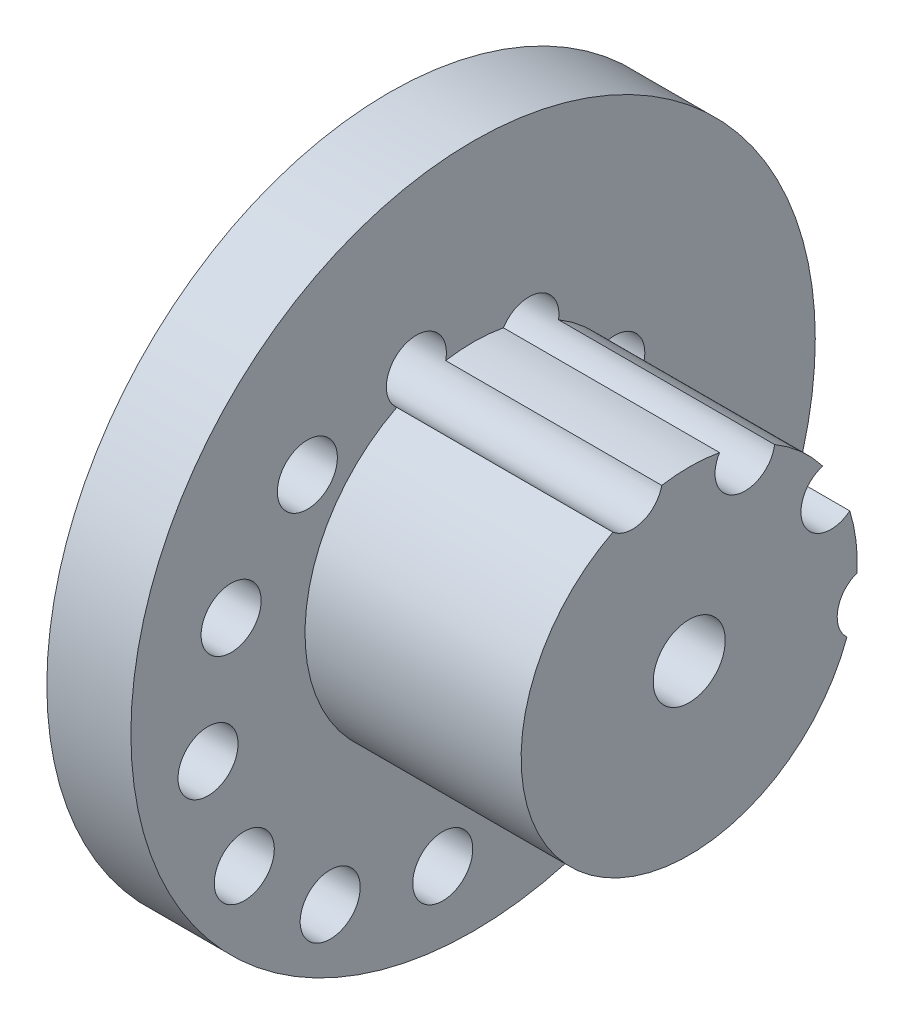
ISO-10303-21;
HEADER;
FILE_DESCRIPTION(('STEP AP214'),'2;1');
FILE_NAME('part.step','',(''),(''),'','','');
FILE_SCHEMA(('AUTOMOTIVE_DESIGN { 1 0 10303 214 1 1 1 1 }'));
ENDSEC;
DATA;
#1=APPLICATION_CONTEXT('core data for automotive mechanical design processes');
#2=APPLICATION_PROTOCOL_DEFINITION('international standard','automotive_design',2000,#1);
#3=PRODUCT_CONTEXT('',#1,'mechanical');
#4=PRODUCT('Part','Part','',(#3));
#5=PRODUCT_RELATED_PRODUCT_CATEGORY('part','',(#4));
#6=PRODUCT_DEFINITION_FORMATION('','',#4);
#7=PRODUCT_DEFINITION_CONTEXT('part definition',#1,'design');
#8=PRODUCT_DEFINITION('design','',#6,#7);
#9=PRODUCT_DEFINITION_SHAPE('','',#8);
#10=(LENGTH_UNIT() NAMED_UNIT(*) SI_UNIT(.MILLI.,.METRE.));
#11=(NAMED_UNIT(*) PLANE_ANGLE_UNIT() SI_UNIT($,.RADIAN.));
#12=(NAMED_UNIT(*) SI_UNIT($,.STERADIAN.) SOLID_ANGLE_UNIT());
#13=UNCERTAINTY_MEASURE_WITH_UNIT(LENGTH_MEASURE(1.E-05),#10,'distance_accuracy_value','');
#14=(GEOMETRIC_REPRESENTATION_CONTEXT(3) GLOBAL_UNCERTAINTY_ASSIGNED_CONTEXT((#13)) GLOBAL_UNIT_ASSIGNED_CONTEXT((#10,
#11,#12)) REPRESENTATION_CONTEXT('',''));
#15=CARTESIAN_POINT('',(0.,0.,0.));
#16=DIRECTION('',(0.,0.,1.));
#17=DIRECTION('',(1.,0.,0.));
#18=AXIS2_PLACEMENT_3D('',#15,#16,#17);
#19=CARTESIAN_POINT('',(25.,0.,0.));
#20=DIRECTION('',(-1.,0.,0.));
#21=DIRECTION('',(0.,0.,1.));
#22=AXIS2_PLACEMENT_3D('',#19,#20,#21);
#23=CYLINDRICAL_SURFACE('',#22,14.);
#24=CARTESIAN_POINT('',(7.,0.,0.));
#25=DIRECTION('',(1.,0.,0.));
#26=DIRECTION('',(0.,0.,-1.));
#27=AXIS2_PLACEMENT_3D('',#24,#25,#26);
#28=CIRCLE('',#27,14.);
#29=CARTESIAN_POINT('',(7.,12.473570059192,6.35688996117042));
#30=VERTEX_POINT('',#29);
#31=CARTESIAN_POINT('',(7.,-4.83305384304245,-13.1393146910428));
#32=VERTEX_POINT('',#31);
#33=EDGE_CURVE('E142',#30,#32,#28,.T.);
#34=ORIENTED_EDGE('',*,*,#33,.T.);
#35=DIRECTION('',(-1.,0.,0.));
#36=VECTOR('',#35,1.);
#37=CARTESIAN_POINT('',(12.499994,-4.83305384304245,-13.1393146910428));
#38=LINE('',#37,#36);
#39=CARTESIAN_POINT('',(25.,-4.83305384304245,-13.1393146910428));
#40=VERTEX_POINT('',#39);
#41=EDGE_CURVE('E263',#32,#40,#38,.F.);
#42=ORIENTED_EDGE('',*,*,#41,.T.);
#43=CARTESIAN_POINT('',(25.,0.,0.));
#44=DIRECTION('',(1.,0.,0.));
#45=DIRECTION('',(0.,0.,-1.));
#46=AXIS2_PLACEMENT_3D('',#43,#44,#45);
#47=CIRCLE('',#46,14.);
#48=CARTESIAN_POINT('',(25.,12.473570059192,6.35688996117042));
#49=VERTEX_POINT('',#48);
#50=EDGE_CURVE('E126',#49,#40,#47,.T.);
#51=ORIENTED_EDGE('',*,*,#50,.F.);
#52=DIRECTION('',(-1.,0.,0.));
#53=VECTOR('',#52,1.);
#54=CARTESIAN_POINT('',(12.499994,12.473570059192,6.35688996117042));
#55=LINE('',#54,#53);
#56=EDGE_CURVE('E59',#49,#30,#55,.T.);
#57=ORIENTED_EDGE('',*,*,#56,.T.);
#58=EDGE_LOOP('',(#34,#42,#51,#57));
#59=FACE_BOUND('',#58,.T.);
#60=ADVANCED_FACE('F35',(#59),#23,.T.);
#61=CARTESIAN_POINT('',(25.,-0.63148830060055,-13.9857506958406));
#62=VERTEX_POINT('',#61);
#63=CARTESIAN_POINT('',(25.,4.14471972768773,-13.3724080994754));
#64=VERTEX_POINT('',#63);
#65=EDGE_CURVE('E129',#62,#64,#47,.T.);
#66=ORIENTED_EDGE('',*,*,#65,.F.);
#67=DIRECTION('',(-1.,0.,0.));
#68=VECTOR('',#67,1.);
#69=CARTESIAN_POINT('',(12.499994,-0.631488300600553,-13.9857506958406));
#70=LINE('',#69,#68);
#71=CARTESIAN_POINT('',(7.,-0.631488300600548,-13.9857506958406));
#72=VERTEX_POINT('',#71);
#73=EDGE_CURVE('E51',#62,#72,#70,.T.);
#74=ORIENTED_EDGE('',*,*,#73,.T.);
#75=CARTESIAN_POINT('',(7.,4.14471972768773,-13.3724080994754));
#76=VERTEX_POINT('',#75);
#77=EDGE_CURVE('E139',#72,#76,#28,.T.);
#78=ORIENTED_EDGE('',*,*,#77,.T.);
#79=DIRECTION('',(-1.,0.,0.));
#80=VECTOR('',#79,1.);
#81=CARTESIAN_POINT('',(12.499994,4.14471972768773,-13.3724080994754));
#82=LINE('',#81,#80);
#83=EDGE_CURVE('E249',#76,#64,#82,.F.);
#84=ORIENTED_EDGE('',*,*,#83,.T.);
#85=EDGE_LOOP('',(#66,#74,#78,#84));
#86=FACE_BOUND('',#85,.T.);
#87=ADVANCED_FACE('F208',(#86),#23,.T.);
#88=CARTESIAN_POINT('',(25.,8.49781006382859,-11.1259707045765));
#89=VERTEX_POINT('',#88);
#90=CARTESIAN_POINT('',(25.,12.055070866313,-7.11865622208094));
#91=VERTEX_POINT('',#90);
#92=EDGE_CURVE('E125',#89,#91,#47,.T.);
#93=ORIENTED_EDGE('',*,*,#92,.F.);
#94=DIRECTION('',(-1.,0.,0.));
#95=VECTOR('',#94,1.);
#96=CARTESIAN_POINT('',(12.499994,8.4978100638286,-11.1259707045765));
#97=LINE('',#96,#95);
#98=CARTESIAN_POINT('',(7.,8.4978100638286,-11.1259707045765));
#99=VERTEX_POINT('',#98);
#100=EDGE_CURVE('E240',#89,#99,#97,.T.);
#101=ORIENTED_EDGE('',*,*,#100,.T.);
#102=CARTESIAN_POINT('',(7.,12.055070866313,-7.11865622208094));
#103=VERTEX_POINT('',#102);
#104=EDGE_CURVE('E143',#99,#103,#28,.T.);
#105=ORIENTED_EDGE('',*,*,#104,.T.);
#106=DIRECTION('',(-1.,0.,0.));
#107=VECTOR('',#106,1.);
#108=CARTESIAN_POINT('',(12.499994,12.055070866313,-7.11865622208094));
#109=LINE('',#108,#107);
#110=EDGE_CURVE('E242',#103,#91,#109,.F.);
#111=ORIENTED_EDGE('',*,*,#110,.T.);
#112=EDGE_LOOP('',(#93,#101,#105,#111));
#113=FACE_BOUND('',#112,.T.);
#114=ADVANCED_FACE('F215',(#113),#23,.T.);
#115=CARTESIAN_POINT('',(7.,0.,0.));
#116=DIRECTION('',(-1.,0.,0.));
#117=DIRECTION('',(0.,0.,1.));
#118=AXIS2_PLACEMENT_3D('',#115,#116,#117);
#119=CYLINDRICAL_SURFACE('',#118,28.5);
#120=CARTESIAN_POINT('',(7.,0.,0.));
#121=DIRECTION('',(1.,0.,0.));
#122=DIRECTION('',(0.,0.,-1.));
#123=AXIS2_PLACEMENT_3D('',#120,#121,#122);
#124=CIRCLE('',#123,28.5);
#125=CARTESIAN_POINT('',(7.,0.,-28.5));
#126=VERTEX_POINT('',#125);
#127=EDGE_CURVE('E144',#126,#126,#124,.T.);
#128=ORIENTED_EDGE('',*,*,#127,.F.);
#129=EDGE_LOOP('',(#128));
#130=FACE_BOUND('',#129,.T.);
#131=CARTESIAN_POINT('',(0.,0.,0.));
#132=DIRECTION('',(1.,0.,0.));
#133=DIRECTION('',(0.,0.,-1.));
#134=AXIS2_PLACEMENT_3D('',#131,#132,#133);
#135=CIRCLE('',#134,28.5);
#136=CARTESIAN_POINT('',(0.,0.,-28.5));
#137=VERTEX_POINT('',#136);
#138=EDGE_CURVE('E128',#137,#137,#135,.T.);
#139=ORIENTED_EDGE('',*,*,#138,.T.);
#140=EDGE_LOOP('',(#139));
#141=FACE_BOUND('',#140,.T.);
#142=ADVANCED_FACE('F37',(#130,#141),#119,.T.);
#143=CARTESIAN_POINT('',(7.,0.,0.));
#144=DIRECTION('',(1.,0.,0.));
#145=DIRECTION('',(0.,0.,-1.));
#146=AXIS2_PLACEMENT_3D('',#143,#144,#145);
#147=PLANE('',#146);
#148=CARTESIAN_POINT('',(7.,-20.6114046100697,11.8999999999999));
#149=DIRECTION('',(1.,0.,0.));
#150=DIRECTION('',(0.,0.,-1.));
#151=AXIS2_PLACEMENT_3D('',#148,#149,#150);
#152=CIRCLE('',#151,2.50000000000002);
#153=CARTESIAN_POINT('',(7.,-20.6114046100697,9.3999999999999));
#154=VERTEX_POINT('',#153);
#155=EDGE_CURVE('E138',#154,#154,#152,.T.);
#156=ORIENTED_EDGE('',*,*,#155,.F.);
#157=EDGE_LOOP('',(#156));
#158=FACE_BOUND('',#157,.T.);
#159=CARTESIAN_POINT('',(7.,-22.534415058268,2.52784292970129));
#160=DIRECTION('',(1.,0.,0.));
#161=DIRECTION('',(0.,0.,-1.));
#162=AXIS2_PLACEMENT_3D('',#159,#160,#161);
#163=CIRCLE('',#162,2.50000000000002);
#164=CARTESIAN_POINT('',(7.,-22.534415058268,0.0278429297012718));
#165=VERTEX_POINT('',#164);
#166=EDGE_CURVE('E177',#165,#165,#163,.T.);
#167=ORIENTED_EDGE('',*,*,#166,.F.);
#168=EDGE_LOOP('',(#167));
#169=FACE_BOUND('',#168,.T.);
#170=CARTESIAN_POINT('',(7.,-19.5137124230012,-6.55018840553435));
#171=DIRECTION('',(1.,0.,0.));
#172=DIRECTION('',(0.,0.,-1.));
#173=AXIS2_PLACEMENT_3D('',#170,#171,#172);
#174=CIRCLE('',#173,2.50000000000002);
#175=CARTESIAN_POINT('',(7.,-19.5137124230012,-9.05018840553437));
#176=VERTEX_POINT('',#175);
#177=EDGE_CURVE('E174',#176,#176,#174,.T.);
#178=ORIENTED_EDGE('',*,*,#177,.F.);
#179=EDGE_LOOP('',(#178));
#180=FACE_BOUND('',#179,.T.);
#181=CARTESIAN_POINT('',(7.,-12.3586915359638,-12.9016428405662));
#182=DIRECTION('',(1.,0.,0.));
#183=DIRECTION('',(0.,0.,-1.));
#184=AXIS2_PLACEMENT_3D('',#181,#182,#183);
#185=CIRCLE('',#184,2.50000000000002);
#186=CARTESIAN_POINT('',(7.,-12.3586915359638,-15.4016428405662));
#187=VERTEX_POINT('',#186);
#188=EDGE_CURVE('E171',#187,#187,#185,.T.);
#189=ORIENTED_EDGE('',*,*,#188,.F.);
#190=EDGE_LOOP('',(#189));
#191=FACE_BOUND('',#190,.T.);
#192=CARTESIAN_POINT('',(7.,-2.98653446566519,-14.8246532887644));
#193=DIRECTION('',(1.,0.,0.));
#194=DIRECTION('',(0.,0.,-1.));
#195=AXIS2_PLACEMENT_3D('',#192,#193,#194);
#196=CIRCLE('',#195,2.50000000000002);
#197=EDGE_CURVE('E261',#32,#72,#196,.T.);
#198=ORIENTED_EDGE('',*,*,#197,.F.);
#199=ORIENTED_EDGE('',*,*,#33,.F.);
#200=CARTESIAN_POINT('',(7.,14.3659617528005,4.72322730383832));
#201=DIRECTION('',(1.,0.,0.));
#202=DIRECTION('',(0.,0.,-1.));
#203=AXIS2_PLACEMENT_3D('',#200,#201,#202);
#204=CIRCLE('',#203,2.50000000000001);
#205=CARTESIAN_POINT('',(7.,13.812215132529,2.28532560759667));
#206=VERTEX_POINT('',#205);
#207=EDGE_CURVE('E118',#206,#30,#204,.T.);
#208=ORIENTED_EDGE('',*,*,#207,.F.);
#209=CARTESIAN_POINT('',(7.,13.7695147702088,-2.52991363350653));
#210=VERTEX_POINT('',#209);
#211=EDGE_CURVE('E116',#210,#206,#28,.T.);
#212=ORIENTED_EDGE('',*,*,#211,.F.);
#213=CARTESIAN_POINT('',(7.,12.4429513046023,-4.64892976646028));
#214=DIRECTION('',(1.,0.,0.));
#215=DIRECTION('',(0.,0.,-1.));
#216=AXIS2_PLACEMENT_3D('',#213,#214,#215);
#217=CIRCLE('',#216,2.50000000000002);
#218=EDGE_CURVE('E470',#103,#210,#217,.T.);
#219=ORIENTED_EDGE('',*,*,#218,.F.);
#220=ORIENTED_EDGE('',*,*,#104,.F.);
#221=CARTESIAN_POINT('',(7.,6.09149686957045,-11.8039506534977));
#222=DIRECTION('',(1.,0.,0.));
#223=DIRECTION('',(0.,0.,-1.));
#224=AXIS2_PLACEMENT_3D('',#221,#222,#223);
#225=CIRCLE('',#224,2.50000000000002);
#226=EDGE_CURVE('E253',#76,#99,#225,.T.);
#227=ORIENTED_EDGE('',*,*,#226,.F.);
#228=ORIENTED_EDGE('',*,*,#77,.F.);
#229=EDGE_LOOP('',(#198,#199,#208,#212,#219,#220,#227,#228));
#230=FACE_BOUND('',#229,.T.);
#231=CARTESIAN_POINT('',(7.,11.3452591175338,13.801258639074));
#232=DIRECTION('',(1.,0.,0.));
#233=DIRECTION('',(0.,0.,-1.));
#234=AXIS2_PLACEMENT_3D('',#231,#232,#233);
#235=CIRCLE('',#234,2.50000000000001);
#236=CARTESIAN_POINT('',(7.,11.3452591175338,11.301258639074));
#237=VERTEX_POINT('',#236);
#238=EDGE_CURVE('E167',#237,#237,#235,.T.);
#239=ORIENTED_EDGE('',*,*,#238,.F.);
#240=EDGE_LOOP('',(#239));
#241=FACE_BOUND('',#240,.T.);
#242=CARTESIAN_POINT('',(7.,4.1902382304964,20.1527130741058));
#243=DIRECTION('',(1.,0.,0.));
#244=DIRECTION('',(0.,0.,-1.));
#245=AXIS2_PLACEMENT_3D('',#242,#243,#244);
#246=CIRCLE('',#245,2.50000000000001);
#247=CARTESIAN_POINT('',(7.,4.1902382304964,17.6527130741058));
#248=VERTEX_POINT('',#247);
#249=EDGE_CURVE('E163',#248,#248,#246,.T.);
#250=ORIENTED_EDGE('',*,*,#249,.F.);
#251=EDGE_LOOP('',(#250));
#252=FACE_BOUND('',#251,.T.);
#253=CARTESIAN_POINT('',(7.,-5.1819188398022,22.0757235223041));
#254=DIRECTION('',(1.,0.,0.));
#255=DIRECTION('',(0.,0.,-1.));
#256=AXIS2_PLACEMENT_3D('',#253,#254,#255);
#257=CIRCLE('',#256,2.50000000000002);
#258=CARTESIAN_POINT('',(7.,-5.1819188398022,19.575723522304));
#259=VERTEX_POINT('',#258);
#260=EDGE_CURVE('E159',#259,#259,#257,.T.);
#261=ORIENTED_EDGE('',*,*,#260,.F.);
#262=EDGE_LOOP('',(#261));
#263=FACE_BOUND('',#262,.T.);
#264=CARTESIAN_POINT('',(7.,-14.2599501750379,19.0550208870373));
#265=DIRECTION('',(1.,0.,0.));
#266=DIRECTION('',(0.,0.,-1.));
#267=AXIS2_PLACEMENT_3D('',#264,#265,#266);
#268=CIRCLE('',#267,2.50000000000002);
#269=CARTESIAN_POINT('',(7.,-14.2599501750379,16.5550208870373));
#270=VERTEX_POINT('',#269);
#271=EDGE_CURVE('E154',#270,#270,#268,.T.);
#272=ORIENTED_EDGE('',*,*,#271,.F.);
#273=EDGE_LOOP('',(#272));
#274=FACE_BOUND('',#273,.T.);
#275=ORIENTED_EDGE('',*,*,#127,.T.);
#276=EDGE_LOOP('',(#275));
#277=FACE_BOUND('',#276,.T.);
#278=ADVANCED_FACE('F234',(#158,#169,#180,#191,#230,#241,#252,#263,#274,#277),#147,.T.);
#279=CARTESIAN_POINT('',(0.,0.,0.));
#280=DIRECTION('',(1.,0.,0.));
#281=DIRECTION('',(0.,0.,-1.));
#282=AXIS2_PLACEMENT_3D('',#279,#280,#281);
#283=PLANE('',#282);
#284=CARTESIAN_POINT('',(0.,-20.6114046100697,11.8999999999999));
#285=DIRECTION('',(1.,0.,0.));
#286=DIRECTION('',(0.,0.,-1.));
#287=AXIS2_PLACEMENT_3D('',#284,#285,#286);
#288=CIRCLE('',#287,2.50000000000002);
#289=CARTESIAN_POINT('',(0.,-20.6114046100697,9.3999999999999));
#290=VERTEX_POINT('',#289);
#291=EDGE_CURVE('E39',#290,#290,#288,.T.);
#292=ORIENTED_EDGE('',*,*,#291,.T.);
#293=EDGE_LOOP('',(#292));
#294=FACE_BOUND('',#293,.T.);
#295=CARTESIAN_POINT('',(0.,-22.534415058268,2.52784292970129));
#296=DIRECTION('',(1.,0.,0.));
#297=DIRECTION('',(0.,0.,-1.));
#298=AXIS2_PLACEMENT_3D('',#295,#296,#297);
#299=CIRCLE('',#298,2.50000000000002);
#300=CARTESIAN_POINT('',(0.,-22.534415058268,0.0278429297012718));
#301=VERTEX_POINT('',#300);
#302=EDGE_CURVE('E175',#301,#301,#299,.T.);
#303=ORIENTED_EDGE('',*,*,#302,.T.);
#304=EDGE_LOOP('',(#303));
#305=FACE_BOUND('',#304,.T.);
#306=CARTESIAN_POINT('',(0.,-19.5137124230012,-6.55018840553435));
#307=DIRECTION('',(1.,0.,0.));
#308=DIRECTION('',(0.,0.,-1.));
#309=AXIS2_PLACEMENT_3D('',#306,#307,#308);
#310=CIRCLE('',#309,2.50000000000002);
#311=CARTESIAN_POINT('',(0.,-19.5137124230012,-9.05018840553437));
#312=VERTEX_POINT('',#311);
#313=EDGE_CURVE('E172',#312,#312,#310,.T.);
#314=ORIENTED_EDGE('',*,*,#313,.T.);
#315=EDGE_LOOP('',(#314));
#316=FACE_BOUND('',#315,.T.);
#317=CARTESIAN_POINT('',(0.,-12.3586915359638,-12.9016428405662));
#318=DIRECTION('',(1.,0.,0.));
#319=DIRECTION('',(0.,0.,-1.));
#320=AXIS2_PLACEMENT_3D('',#317,#318,#319);
#321=CIRCLE('',#320,2.50000000000002);
#322=CARTESIAN_POINT('',(0.,-12.3586915359638,-15.4016428405662));
#323=VERTEX_POINT('',#322);
#324=EDGE_CURVE('E168',#323,#323,#321,.T.);
#325=ORIENTED_EDGE('',*,*,#324,.T.);
#326=EDGE_LOOP('',(#325));
#327=FACE_BOUND('',#326,.T.);
#328=CARTESIAN_POINT('',(0.,-2.98653446566519,-14.8246532887644));
#329=DIRECTION('',(1.,0.,0.));
#330=DIRECTION('',(0.,0.,-1.));
#331=AXIS2_PLACEMENT_3D('',#328,#329,#330);
#332=CIRCLE('',#331,2.50000000000002);
#333=CARTESIAN_POINT('',(0.,-2.98653446566519,-17.3246532887645));
#334=VERTEX_POINT('',#333);
#335=EDGE_CURVE('E155',#334,#334,#332,.T.);
#336=ORIENTED_EDGE('',*,*,#335,.T.);
#337=EDGE_LOOP('',(#336));
#338=FACE_BOUND('',#337,.T.);
#339=CARTESIAN_POINT('',(0.,6.09149686957045,-11.8039506534977));
#340=DIRECTION('',(1.,0.,0.));
#341=DIRECTION('',(0.,0.,-1.));
#342=AXIS2_PLACEMENT_3D('',#339,#340,#341);
#343=CIRCLE('',#342,2.50000000000002);
#344=CARTESIAN_POINT('',(0.,6.09149686957045,-14.3039506534977));
#345=VERTEX_POINT('',#344);
#346=EDGE_CURVE('E252',#345,#345,#343,.T.);
#347=ORIENTED_EDGE('',*,*,#346,.T.);
#348=EDGE_LOOP('',(#347));
#349=FACE_BOUND('',#348,.T.);
#350=CARTESIAN_POINT('',(0.,12.4429513046023,-4.64892976646028));
#351=DIRECTION('',(1.,0.,0.));
#352=DIRECTION('',(0.,0.,-1.));
#353=AXIS2_PLACEMENT_3D('',#350,#351,#352);
#354=CIRCLE('',#353,2.50000000000002);
#355=CARTESIAN_POINT('',(0.,12.4429513046023,-7.1489297664603));
#356=VERTEX_POINT('',#355);
#357=EDGE_CURVE('E454',#356,#356,#354,.T.);
#358=ORIENTED_EDGE('',*,*,#357,.T.);
#359=EDGE_LOOP('',(#358));
#360=FACE_BOUND('',#359,.T.);
#361=CARTESIAN_POINT('',(0.,14.3659617528005,4.72322730383832));
#362=DIRECTION('',(1.,0.,0.));
#363=DIRECTION('',(0.,0.,-1.));
#364=AXIS2_PLACEMENT_3D('',#361,#362,#363);
#365=CIRCLE('',#364,2.50000000000001);
#366=CARTESIAN_POINT('',(0.,14.3659617528005,2.22322730383831));
#367=VERTEX_POINT('',#366);
#368=EDGE_CURVE('E117',#367,#367,#365,.T.);
#369=ORIENTED_EDGE('',*,*,#368,.T.);
#370=EDGE_LOOP('',(#369));
#371=FACE_BOUND('',#370,.T.);
#372=CARTESIAN_POINT('',(0.,11.3452591175338,13.801258639074));
#373=DIRECTION('',(1.,0.,0.));
#374=DIRECTION('',(0.,0.,-1.));
#375=AXIS2_PLACEMENT_3D('',#372,#373,#374);
#376=CIRCLE('',#375,2.50000000000001);
#377=CARTESIAN_POINT('',(0.,11.3452591175338,11.301258639074));
#378=VERTEX_POINT('',#377);
#379=EDGE_CURVE('E164',#378,#378,#376,.T.);
#380=ORIENTED_EDGE('',*,*,#379,.T.);
#381=EDGE_LOOP('',(#380));
#382=FACE_BOUND('',#381,.T.);
#383=CARTESIAN_POINT('',(0.,4.1902382304964,20.1527130741058));
#384=DIRECTION('',(1.,0.,0.));
#385=DIRECTION('',(0.,0.,-1.));
#386=AXIS2_PLACEMENT_3D('',#383,#384,#385);
#387=CIRCLE('',#386,2.50000000000001);
#388=CARTESIAN_POINT('',(0.,4.1902382304964,17.6527130741058));
#389=VERTEX_POINT('',#388);
#390=EDGE_CURVE('E160',#389,#389,#387,.T.);
#391=ORIENTED_EDGE('',*,*,#390,.T.);
#392=EDGE_LOOP('',(#391));
#393=FACE_BOUND('',#392,.T.);
#394=CARTESIAN_POINT('',(0.,-5.1819188398022,22.0757235223041));
#395=DIRECTION('',(1.,0.,0.));
#396=DIRECTION('',(0.,0.,-1.));
#397=AXIS2_PLACEMENT_3D('',#394,#395,#396);
#398=CIRCLE('',#397,2.50000000000002);
#399=CARTESIAN_POINT('',(0.,-5.1819188398022,19.575723522304));
#400=VERTEX_POINT('',#399);
#401=EDGE_CURVE('E156',#400,#400,#398,.T.);
#402=ORIENTED_EDGE('',*,*,#401,.T.);
#403=EDGE_LOOP('',(#402));
#404=FACE_BOUND('',#403,.T.);
#405=CARTESIAN_POINT('',(0.,-14.2599501750379,19.0550208870373));
#406=DIRECTION('',(1.,0.,0.));
#407=DIRECTION('',(0.,0.,-1.));
#408=AXIS2_PLACEMENT_3D('',#405,#406,#407);
#409=CIRCLE('',#408,2.50000000000002);
#410=CARTESIAN_POINT('',(0.,-14.2599501750379,16.5550208870373));
#411=VERTEX_POINT('',#410);
#412=EDGE_CURVE('E151',#411,#411,#409,.T.);
#413=ORIENTED_EDGE('',*,*,#412,.T.);
#414=EDGE_LOOP('',(#413));
#415=FACE_BOUND('',#414,.T.);
#416=ORIENTED_EDGE('',*,*,#138,.F.);
#417=EDGE_LOOP('',(#416));
#418=FACE_BOUND('',#417,.T.);
#419=CARTESIAN_POINT('',(0.,0.,0.));
#420=DIRECTION('',(1.,0.,0.));
#421=DIRECTION('',(0.,0.,-1.));
#422=AXIS2_PLACEMENT_3D('',#419,#420,#421);
#423=CIRCLE('',#422,3.);
#424=CARTESIAN_POINT('',(0.,0.,-3.));
#425=VERTEX_POINT('',#424);
#426=EDGE_CURVE('E135',#425,#425,#423,.T.);
#427=ORIENTED_EDGE('',*,*,#426,.T.);
#428=EDGE_LOOP('',(#427));
#429=FACE_BOUND('',#428,.T.);
#430=ADVANCED_FACE('F194',(#294,#305,#316,#327,#338,#349,#360,#371,#382,#393,#404,#415,#418,
#429),#283,.F.);
#431=CARTESIAN_POINT('',(25.,0.,0.));
#432=DIRECTION('',(-1.,0.,0.));
#433=DIRECTION('',(0.,0.,1.));
#434=AXIS2_PLACEMENT_3D('',#431,#432,#433);
#435=CYLINDRICAL_SURFACE('',#434,3.);
#436=CARTESIAN_POINT('',(25.,0.,0.));
#437=DIRECTION('',(1.,0.,0.));
#438=DIRECTION('',(0.,0.,-1.));
#439=AXIS2_PLACEMENT_3D('',#436,#437,#438);
#440=CIRCLE('',#439,3.);
#441=CARTESIAN_POINT('',(25.,0.,-3.));
#442=VERTEX_POINT('',#441);
#443=EDGE_CURVE('E133',#442,#442,#440,.T.);
#444=ORIENTED_EDGE('',*,*,#443,.T.);
#445=EDGE_LOOP('',(#444));
#446=FACE_BOUND('',#445,.T.);
#447=ORIENTED_EDGE('',*,*,#426,.F.);
#448=EDGE_LOOP('',(#447));
#449=FACE_BOUND('',#448,.T.);
#450=ADVANCED_FACE('F221',(#446,#449),#435,.F.);
#451=CARTESIAN_POINT('',(25.,13.7695147702088,-2.52991363350653));
#452=VERTEX_POINT('',#451);
#453=CARTESIAN_POINT('',(25.,13.812215132529,2.28532560759667));
#454=VERTEX_POINT('',#453);
#455=EDGE_CURVE('E114',#452,#454,#47,.T.);
#456=ORIENTED_EDGE('',*,*,#455,.F.);
#457=DIRECTION('',(-1.,0.,0.));
#458=VECTOR('',#457,1.);
#459=CARTESIAN_POINT('',(12.499994,13.7695147702088,-2.52991363350653));
#460=LINE('',#459,#458);
#461=EDGE_CURVE('E468',#452,#210,#460,.T.);
#462=ORIENTED_EDGE('',*,*,#461,.T.);
#463=ORIENTED_EDGE('',*,*,#211,.T.);
#464=DIRECTION('',(-1.,0.,0.));
#465=VECTOR('',#464,1.);
#466=CARTESIAN_POINT('',(12.499994,13.812215132529,2.28532560759667));
#467=LINE('',#466,#465);
#468=EDGE_CURVE('E102',#206,#454,#467,.F.);
#469=ORIENTED_EDGE('',*,*,#468,.T.);
#470=EDGE_LOOP('',(#456,#462,#463,#469));
#471=FACE_BOUND('',#470,.T.);
#472=ADVANCED_FACE('F112',(#471),#23,.T.);
#473=CARTESIAN_POINT('',(25.,0.,0.));
#474=DIRECTION('',(1.,0.,0.));
#475=DIRECTION('',(0.,0.,-1.));
#476=AXIS2_PLACEMENT_3D('',#473,#474,#475);
#477=PLANE('',#476);
#478=CARTESIAN_POINT('',(25.,-2.98653446566519,-14.8246532887644));
#479=DIRECTION('',(1.,0.,0.));
#480=DIRECTION('',(0.,0.,-1.));
#481=AXIS2_PLACEMENT_3D('',#478,#479,#480);
#482=CIRCLE('',#481,2.50000000000002);
#483=EDGE_CURVE('E11',#62,#40,#482,.T.);
#484=ORIENTED_EDGE('',*,*,#483,.F.);
#485=ORIENTED_EDGE('',*,*,#65,.T.);
#486=CARTESIAN_POINT('',(25.,6.09149686957045,-11.8039506534977));
#487=DIRECTION('',(1.,0.,0.));
#488=DIRECTION('',(0.,0.,-1.));
#489=AXIS2_PLACEMENT_3D('',#486,#487,#488);
#490=CIRCLE('',#489,2.50000000000002);
#491=EDGE_CURVE('E44',#89,#64,#490,.T.);
#492=ORIENTED_EDGE('',*,*,#491,.F.);
#493=ORIENTED_EDGE('',*,*,#92,.T.);
#494=CARTESIAN_POINT('',(25.,12.4429513046023,-4.64892976646028));
#495=DIRECTION('',(1.,0.,0.));
#496=DIRECTION('',(0.,0.,-1.));
#497=AXIS2_PLACEMENT_3D('',#494,#495,#496);
#498=CIRCLE('',#497,2.50000000000002);
#499=EDGE_CURVE('E124',#452,#91,#498,.T.);
#500=ORIENTED_EDGE('',*,*,#499,.F.);
#501=ORIENTED_EDGE('',*,*,#455,.T.);
#502=CARTESIAN_POINT('',(25.,14.3659617528005,4.72322730383832));
#503=DIRECTION('',(-1.,0.,0.));
#504=DIRECTION('',(0.,0.,1.));
#505=AXIS2_PLACEMENT_3D('',#502,#503,#504);
#506=CIRCLE('',#505,2.50000000000001);
#507=EDGE_CURVE('E98',#454,#49,#506,.T.);
#508=ORIENTED_EDGE('',*,*,#507,.T.);
#509=ORIENTED_EDGE('',*,*,#50,.T.);
#510=EDGE_LOOP('',(#484,#485,#492,#493,#500,#501,#508,#509));
#511=FACE_BOUND('',#510,.T.);
#512=ORIENTED_EDGE('',*,*,#443,.F.);
#513=EDGE_LOOP('',(#512));
#514=FACE_BOUND('',#513,.T.);
#515=ADVANCED_FACE('F121',(#511,#514),#477,.T.);
#516=CARTESIAN_POINT('',(25.,14.3659617528005,4.72322730383832));
#517=DIRECTION('',(-1.,0.,0.));
#518=DIRECTION('',(0.,0.,1.));
#519=AXIS2_PLACEMENT_3D('',#516,#517,#518);
#520=CYLINDRICAL_SURFACE('',#519,2.50000000000001);
#521=ORIENTED_EDGE('',*,*,#207,.T.);
#522=ORIENTED_EDGE('',*,*,#56,.F.);
#523=ORIENTED_EDGE('',*,*,#507,.F.);
#524=ORIENTED_EDGE('',*,*,#468,.F.);
#525=EDGE_LOOP('',(#521,#522,#523,#524));
#526=FACE_BOUND('',#525,.T.);
#527=ORIENTED_EDGE('',*,*,#368,.F.);
#528=EDGE_LOOP('',(#527));
#529=FACE_BOUND('',#528,.T.);
#530=ADVANCED_FACE('F100',(#526,#529),#520,.F.);
#531=CARTESIAN_POINT('',(25.,12.4429513046023,-4.64892976646028));
#532=DIRECTION('',(-1.,0.,0.));
#533=DIRECTION('',(0.,0.,1.));
#534=AXIS2_PLACEMENT_3D('',#531,#532,#533);
#535=CYLINDRICAL_SURFACE('',#534,2.50000000000002);
#536=ORIENTED_EDGE('',*,*,#218,.T.);
#537=ORIENTED_EDGE('',*,*,#461,.F.);
#538=ORIENTED_EDGE('',*,*,#499,.T.);
#539=ORIENTED_EDGE('',*,*,#110,.F.);
#540=EDGE_LOOP('',(#536,#537,#538,#539));
#541=FACE_BOUND('',#540,.T.);
#542=ORIENTED_EDGE('',*,*,#357,.F.);
#543=EDGE_LOOP('',(#542));
#544=FACE_BOUND('',#543,.T.);
#545=ADVANCED_FACE('F346',(#541,#544),#535,.F.);
#546=CARTESIAN_POINT('',(25.,6.09149686957045,-11.8039506534977));
#547=DIRECTION('',(-1.,0.,0.));
#548=DIRECTION('',(0.,0.,1.));
#549=AXIS2_PLACEMENT_3D('',#546,#547,#548);
#550=CYLINDRICAL_SURFACE('',#549,2.50000000000002);
#551=ORIENTED_EDGE('',*,*,#226,.T.);
#552=ORIENTED_EDGE('',*,*,#100,.F.);
#553=ORIENTED_EDGE('',*,*,#491,.T.);
#554=ORIENTED_EDGE('',*,*,#83,.F.);
#555=EDGE_LOOP('',(#551,#552,#553,#554));
#556=FACE_BOUND('',#555,.T.);
#557=ORIENTED_EDGE('',*,*,#346,.F.);
#558=EDGE_LOOP('',(#557));
#559=FACE_BOUND('',#558,.T.);
#560=ADVANCED_FACE('F247',(#556,#559),#550,.F.);
#561=CARTESIAN_POINT('',(25.,-2.98653446566519,-14.8246532887644));
#562=DIRECTION('',(-1.,0.,0.));
#563=DIRECTION('',(0.,0.,1.));
#564=AXIS2_PLACEMENT_3D('',#561,#562,#563);
#565=CYLINDRICAL_SURFACE('',#564,2.50000000000002);
#566=ORIENTED_EDGE('',*,*,#197,.T.);
#567=ORIENTED_EDGE('',*,*,#73,.F.);
#568=ORIENTED_EDGE('',*,*,#483,.T.);
#569=ORIENTED_EDGE('',*,*,#41,.F.);
#570=EDGE_LOOP('',(#566,#567,#568,#569));
#571=FACE_BOUND('',#570,.T.);
#572=ORIENTED_EDGE('',*,*,#335,.F.);
#573=EDGE_LOOP('',(#572));
#574=FACE_BOUND('',#573,.T.);
#575=ADVANCED_FACE('F359',(#571,#574),#565,.F.);
#576=CARTESIAN_POINT('',(25.,-14.2599501750379,19.0550208870373));
#577=DIRECTION('',(-1.,0.,0.));
#578=DIRECTION('',(0.,0.,1.));
#579=AXIS2_PLACEMENT_3D('',#576,#577,#578);
#580=CYLINDRICAL_SURFACE('',#579,2.50000000000002);
#581=ORIENTED_EDGE('',*,*,#271,.T.);
#582=EDGE_LOOP('',(#581));
#583=FACE_BOUND('',#582,.T.);
#584=ORIENTED_EDGE('',*,*,#412,.F.);
#585=EDGE_LOOP('',(#584));
#586=FACE_BOUND('',#585,.T.);
#587=ADVANCED_FACE('F366',(#583,#586),#580,.F.);
#588=CARTESIAN_POINT('',(25.,-5.1819188398022,22.0757235223041));
#589=DIRECTION('',(-1.,0.,0.));
#590=DIRECTION('',(0.,0.,1.));
#591=AXIS2_PLACEMENT_3D('',#588,#589,#590);
#592=CYLINDRICAL_SURFACE('',#591,2.50000000000002);
#593=ORIENTED_EDGE('',*,*,#260,.T.);
#594=EDGE_LOOP('',(#593));
#595=FACE_BOUND('',#594,.T.);
#596=ORIENTED_EDGE('',*,*,#401,.F.);
#597=EDGE_LOOP('',(#596));
#598=FACE_BOUND('',#597,.T.);
#599=ADVANCED_FACE('F373',(#595,#598),#592,.F.);
#600=CARTESIAN_POINT('',(25.,4.1902382304964,20.1527130741058));
#601=DIRECTION('',(-1.,0.,0.));
#602=DIRECTION('',(0.,0.,1.));
#603=AXIS2_PLACEMENT_3D('',#600,#601,#602);
#604=CYLINDRICAL_SURFACE('',#603,2.50000000000001);
#605=ORIENTED_EDGE('',*,*,#249,.T.);
#606=EDGE_LOOP('',(#605));
#607=FACE_BOUND('',#606,.T.);
#608=ORIENTED_EDGE('',*,*,#390,.F.);
#609=EDGE_LOOP('',(#608));
#610=FACE_BOUND('',#609,.T.);
#611=ADVANCED_FACE('F381',(#607,#610),#604,.F.);
#612=CARTESIAN_POINT('',(25.,11.3452591175338,13.801258639074));
#613=DIRECTION('',(-1.,0.,0.));
#614=DIRECTION('',(0.,0.,1.));
#615=AXIS2_PLACEMENT_3D('',#612,#613,#614);
#616=CYLINDRICAL_SURFACE('',#615,2.50000000000001);
#617=ORIENTED_EDGE('',*,*,#238,.T.);
#618=EDGE_LOOP('',(#617));
#619=FACE_BOUND('',#618,.T.);
#620=ORIENTED_EDGE('',*,*,#379,.F.);
#621=EDGE_LOOP('',(#620));
#622=FACE_BOUND('',#621,.T.);
#623=ADVANCED_FACE('F276',(#619,#622),#616,.F.);
#624=CARTESIAN_POINT('',(25.,-12.3586915359638,-12.9016428405662));
#625=DIRECTION('',(-1.,0.,0.));
#626=DIRECTION('',(0.,0.,1.));
#627=AXIS2_PLACEMENT_3D('',#624,#625,#626);
#628=CYLINDRICAL_SURFACE('',#627,2.50000000000002);
#629=ORIENTED_EDGE('',*,*,#188,.T.);
#630=EDGE_LOOP('',(#629));
#631=FACE_BOUND('',#630,.T.);
#632=ORIENTED_EDGE('',*,*,#324,.F.);
#633=EDGE_LOOP('',(#632));
#634=FACE_BOUND('',#633,.T.);
#635=ADVANCED_FACE('F395',(#631,#634),#628,.F.);
#636=CARTESIAN_POINT('',(25.,-19.5137124230012,-6.55018840553435));
#637=DIRECTION('',(-1.,0.,0.));
#638=DIRECTION('',(0.,0.,1.));
#639=AXIS2_PLACEMENT_3D('',#636,#637,#638);
#640=CYLINDRICAL_SURFACE('',#639,2.50000000000002);
#641=ORIENTED_EDGE('',*,*,#177,.T.);
#642=EDGE_LOOP('',(#641));
#643=FACE_BOUND('',#642,.T.);
#644=ORIENTED_EDGE('',*,*,#313,.F.);
#645=EDGE_LOOP('',(#644));
#646=FACE_BOUND('',#645,.T.);
#647=ADVANCED_FACE('F203',(#643,#646),#640,.F.);
#648=CARTESIAN_POINT('',(25.,-22.534415058268,2.52784292970129));
#649=DIRECTION('',(-1.,0.,0.));
#650=DIRECTION('',(0.,0.,1.));
#651=AXIS2_PLACEMENT_3D('',#648,#649,#650);
#652=CYLINDRICAL_SURFACE('',#651,2.50000000000002);
#653=ORIENTED_EDGE('',*,*,#166,.T.);
#654=EDGE_LOOP('',(#653));
#655=FACE_BOUND('',#654,.T.);
#656=ORIENTED_EDGE('',*,*,#302,.F.);
#657=EDGE_LOOP('',(#656));
#658=FACE_BOUND('',#657,.T.);
#659=ADVANCED_FACE('F198',(#655,#658),#652,.F.);
#660=CARTESIAN_POINT('',(25.,-20.6114046100697,11.8999999999999));
#661=DIRECTION('',(-1.,0.,0.));
#662=DIRECTION('',(0.,0.,1.));
#663=AXIS2_PLACEMENT_3D('',#660,#661,#662);
#664=CYLINDRICAL_SURFACE('',#663,2.50000000000002);
#665=ORIENTED_EDGE('',*,*,#155,.T.);
#666=EDGE_LOOP('',(#665));
#667=FACE_BOUND('',#666,.T.);
#668=ORIENTED_EDGE('',*,*,#291,.F.);
#669=EDGE_LOOP('',(#668));
#670=FACE_BOUND('',#669,.T.);
#671=ADVANCED_FACE('F196',(#667,#670),#664,.F.);
#672=CLOSED_SHELL('',(#60,#87,#114,#142,#278,#430,#450,#472,#515,#530,#545,#560,#575,#587,#599,
#611,#623,#635,#647,#659,#671));
#673=MANIFOLD_SOLID_BREP('B2',#672);
#674=ADVANCED_BREP_SHAPE_REPRESENTATION('',(#18,#673),#14);
#675=SHAPE_DEFINITION_REPRESENTATION(#9,#674);
ENDSEC;
END-ISO-10303-21;
